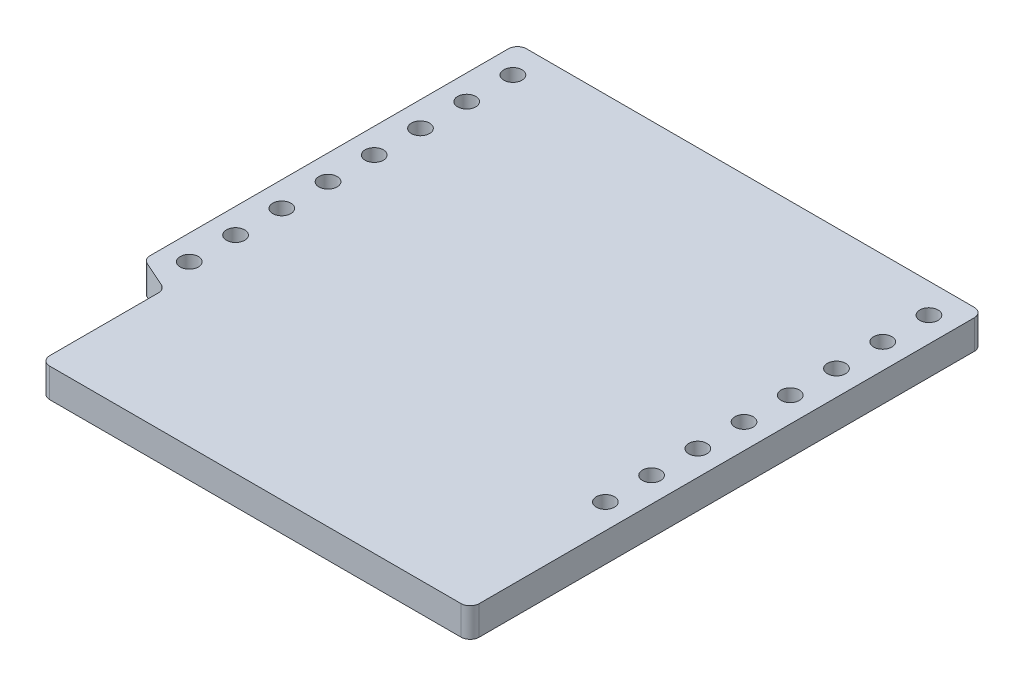
ISO-10303-21;
HEADER;
FILE_DESCRIPTION(('STEP AP214'),'2;1');
FILE_NAME('part.step','',(''),(''),'','','');
FILE_SCHEMA(('AUTOMOTIVE_DESIGN { 1 0 10303 214 1 1 1 1 }'));
ENDSEC;
DATA;
#1=APPLICATION_CONTEXT('core data for automotive mechanical design processes');
#2=APPLICATION_PROTOCOL_DEFINITION('international standard','automotive_design',2000,#1);
#3=PRODUCT_CONTEXT('',#1,'mechanical');
#4=PRODUCT('Part','Part','',(#3));
#5=PRODUCT_RELATED_PRODUCT_CATEGORY('part','',(#4));
#6=PRODUCT_DEFINITION_FORMATION('','',#4);
#7=PRODUCT_DEFINITION_CONTEXT('part definition',#1,'design');
#8=PRODUCT_DEFINITION('design','',#6,#7);
#9=PRODUCT_DEFINITION_SHAPE('','',#8);
#10=(LENGTH_UNIT() NAMED_UNIT(*) SI_UNIT(.MILLI.,.METRE.));
#11=(NAMED_UNIT(*) PLANE_ANGLE_UNIT() SI_UNIT($,.RADIAN.));
#12=(NAMED_UNIT(*) SI_UNIT($,.STERADIAN.) SOLID_ANGLE_UNIT());
#13=UNCERTAINTY_MEASURE_WITH_UNIT(LENGTH_MEASURE(1.E-05),#10,'distance_accuracy_value','');
#14=(GEOMETRIC_REPRESENTATION_CONTEXT(3) GLOBAL_UNCERTAINTY_ASSIGNED_CONTEXT((#13)) GLOBAL_UNIT_ASSIGNED_CONTEXT((#10,
#11,#12)) REPRESENTATION_CONTEXT('',''));
#15=CARTESIAN_POINT('',(0.,0.,0.));
#16=DIRECTION('',(0.,0.,1.));
#17=DIRECTION('',(1.,0.,0.));
#18=AXIS2_PLACEMENT_3D('',#15,#16,#17);
#19=CARTESIAN_POINT('',(0.,1.6,0.));
#20=DIRECTION('',(0.,-1.,0.));
#21=DIRECTION('',(0.,0.,-1.));
#22=AXIS2_PLACEMENT_3D('',#19,#20,#21);
#23=PLANE('',#22);
#24=DIRECTION('',(0.,0.,1.));
#25=VECTOR('',#24,1.);
#26=CARTESIAN_POINT('',(-10.8,1.6,0.));
#27=LINE('',#26,#25);
#28=CARTESIAN_POINT('',(-10.8,1.6,-6.47529620340124));
#29=VERTEX_POINT('',#28);
#30=CARTESIAN_POINT('',(-10.8,1.6,-0.5));
#31=VERTEX_POINT('',#30);
#32=EDGE_CURVE('E207',#29,#31,#27,.T.);
#33=ORIENTED_EDGE('',*,*,#32,.T.);
#34=CARTESIAN_POINT('',(-10.3,1.6,-0.5));
#35=DIRECTION('',(0.,-1.,0.));
#36=DIRECTION('',(0.,0.,-1.));
#37=AXIS2_PLACEMENT_3D('',#34,#35,#36);
#38=CIRCLE('',#37,0.5);
#39=CARTESIAN_POINT('',(-10.3,1.6,0.));
#40=VERTEX_POINT('',#39);
#41=EDGE_CURVE('E176',#31,#40,#38,.F.);
#42=ORIENTED_EDGE('',*,*,#41,.T.);
#43=DIRECTION('',(1.,0.,0.));
#44=VECTOR('',#43,1.);
#45=CARTESIAN_POINT('',(-10.8,1.6,0.));
#46=LINE('',#45,#44);
#47=CARTESIAN_POINT('',(12.3,1.6,0.));
#48=VERTEX_POINT('',#47);
#49=EDGE_CURVE('E142',#40,#48,#46,.T.);
#50=ORIENTED_EDGE('',*,*,#49,.T.);
#51=CARTESIAN_POINT('',(12.3,1.6,-0.5));
#52=DIRECTION('',(0.,-1.,0.));
#53=DIRECTION('',(0.,0.,-1.));
#54=AXIS2_PLACEMENT_3D('',#51,#52,#53);
#55=CIRCLE('',#54,0.5);
#56=CARTESIAN_POINT('',(12.8,1.6,-0.5));
#57=VERTEX_POINT('',#56);
#58=EDGE_CURVE('E169',#48,#57,#55,.F.);
#59=ORIENTED_EDGE('',*,*,#58,.T.);
#60=DIRECTION('',(0.,0.,-1.));
#61=VECTOR('',#60,1.);
#62=CARTESIAN_POINT('',(12.8,1.6,0.));
#63=LINE('',#62,#61);
#64=CARTESIAN_POINT('',(12.8,1.6,-27.7));
#65=VERTEX_POINT('',#64);
#66=EDGE_CURVE('E149',#57,#65,#63,.T.);
#67=ORIENTED_EDGE('',*,*,#66,.T.);
#68=CARTESIAN_POINT('',(12.3,1.6,-27.7));
#69=DIRECTION('',(0.,-1.,0.));
#70=DIRECTION('',(0.,0.,-1.));
#71=AXIS2_PLACEMENT_3D('',#68,#69,#70);
#72=CIRCLE('',#71,0.5);
#73=CARTESIAN_POINT('',(12.3,1.6,-28.2));
#74=VERTEX_POINT('',#73);
#75=EDGE_CURVE('E171',#65,#74,#72,.F.);
#76=ORIENTED_EDGE('',*,*,#75,.T.);
#77=DIRECTION('',(-1.,0.,0.));
#78=VECTOR('',#77,1.);
#79=CARTESIAN_POINT('',(-12.8,1.6,-28.2));
#80=LINE('',#79,#78);
#81=CARTESIAN_POINT('',(-12.3,1.6,-28.2));
#82=VERTEX_POINT('',#81);
#83=EDGE_CURVE('E153',#74,#82,#80,.T.);
#84=ORIENTED_EDGE('',*,*,#83,.T.);
#85=CARTESIAN_POINT('',(-12.3,1.6,-27.7));
#86=DIRECTION('',(0.,-1.,0.));
#87=DIRECTION('',(0.,0.,-1.));
#88=AXIS2_PLACEMENT_3D('',#85,#86,#87);
#89=CIRCLE('',#88,0.5);
#90=CARTESIAN_POINT('',(-12.8,1.6,-27.7));
#91=VERTEX_POINT('',#90);
#92=EDGE_CURVE('E173',#82,#91,#89,.F.);
#93=ORIENTED_EDGE('',*,*,#92,.T.);
#94=DIRECTION('',(0.,0.,1.));
#95=VECTOR('',#94,1.);
#96=CARTESIAN_POINT('',(-12.8,1.6,-7.69045737061706));
#97=LINE('',#96,#95);
#98=CARTESIAN_POINT('',(-12.8,1.6,-8.01516116721582));
#99=VERTEX_POINT('',#98);
#100=EDGE_CURVE('E213',#91,#99,#97,.T.);
#101=ORIENTED_EDGE('',*,*,#100,.T.);
#102=CARTESIAN_POINT('',(-12.3,1.6,-8.01516116721582));
#103=DIRECTION('',(0.,-1.,0.));
#104=DIRECTION('',(0.,0.,-1.));
#105=AXIS2_PLACEMENT_3D('',#102,#103,#104);
#106=CIRCLE('',#105,0.5);
#107=CARTESIAN_POINT('',(-12.5033683215379,1.6,-7.55838843839452));
#108=VERTEX_POINT('',#107);
#109=EDGE_CURVE('E54',#99,#108,#106,.F.);
#110=ORIENTED_EDGE('',*,*,#109,.T.);
#111=DIRECTION('',(0.913545457642602,0.,0.406736643075797));
#112=VECTOR('',#111,1.);
#113=CARTESIAN_POINT('',(-10.8,1.6,-6.8));
#114=LINE('',#113,#112);
#115=CARTESIAN_POINT('',(-11.0966316784621,1.6,-6.93206893222254));
#116=VERTEX_POINT('',#115);
#117=EDGE_CURVE('E208',#108,#116,#114,.T.);
#118=ORIENTED_EDGE('',*,*,#117,.T.);
#119=CARTESIAN_POINT('',(-11.3,1.6,-6.47529620340124));
#120=DIRECTION('',(0.,-1.,0.));
#121=DIRECTION('',(0.,0.,-1.));
#122=AXIS2_PLACEMENT_3D('',#119,#120,#121);
#123=CIRCLE('',#122,0.5);
#124=EDGE_CURVE('E11',#116,#29,#123,.T.);
#125=ORIENTED_EDGE('',*,*,#124,.T.);
#126=EDGE_LOOP('',(#33,#42,#50,#59,#67,#76,#84,#93,#101,#110,#118,#125));
#127=FACE_BOUND('',#126,.T.);
#128=CARTESIAN_POINT('',(-11.43,1.6,-26.58));
#129=DIRECTION('',(0.,1.,0.));
#130=DIRECTION('',(0.,0.,1.));
#131=AXIS2_PLACEMENT_3D('',#128,#129,#130);
#132=CIRCLE('',#131,0.500000000000001);
#133=CARTESIAN_POINT('',(-11.43,1.6,-26.08));
#134=VERTEX_POINT('',#133);
#135=EDGE_CURVE('E221',#134,#134,#132,.T.);
#136=ORIENTED_EDGE('',*,*,#135,.F.);
#137=EDGE_LOOP('',(#136));
#138=FACE_BOUND('',#137,.T.);
#139=CARTESIAN_POINT('',(11.43,1.6,-26.58));
#140=DIRECTION('',(0.,1.,0.));
#141=DIRECTION('',(0.,0.,1.));
#142=AXIS2_PLACEMENT_3D('',#139,#140,#141);
#143=CIRCLE('',#142,0.500000000000001);
#144=CARTESIAN_POINT('',(11.43,1.6,-26.08));
#145=VERTEX_POINT('',#144);
#146=EDGE_CURVE('E344',#145,#145,#143,.T.);
#147=ORIENTED_EDGE('',*,*,#146,.F.);
#148=EDGE_LOOP('',(#147));
#149=FACE_BOUND('',#148,.T.);
#150=CARTESIAN_POINT('',(-11.43,1.6,-24.04));
#151=DIRECTION('',(0.,1.,0.));
#152=DIRECTION('',(0.,0.,1.));
#153=AXIS2_PLACEMENT_3D('',#150,#151,#152);
#154=CIRCLE('',#153,0.500000000000001);
#155=CARTESIAN_POINT('',(-11.43,1.6,-23.54));
#156=VERTEX_POINT('',#155);
#157=EDGE_CURVE('E348',#156,#156,#154,.T.);
#158=ORIENTED_EDGE('',*,*,#157,.F.);
#159=EDGE_LOOP('',(#158));
#160=FACE_BOUND('',#159,.T.);
#161=CARTESIAN_POINT('',(11.43,1.6,-24.04));
#162=DIRECTION('',(0.,1.,0.));
#163=DIRECTION('',(0.,0.,1.));
#164=AXIS2_PLACEMENT_3D('',#161,#162,#163);
#165=CIRCLE('',#164,0.500000000000001);
#166=CARTESIAN_POINT('',(11.43,1.6,-23.54));
#167=VERTEX_POINT('',#166);
#168=EDGE_CURVE('E557',#167,#167,#165,.T.);
#169=ORIENTED_EDGE('',*,*,#168,.F.);
#170=EDGE_LOOP('',(#169));
#171=FACE_BOUND('',#170,.T.);
#172=CARTESIAN_POINT('',(-11.43,1.6,-21.5));
#173=DIRECTION('',(0.,1.,0.));
#174=DIRECTION('',(0.,0.,1.));
#175=AXIS2_PLACEMENT_3D('',#172,#173,#174);
#176=CIRCLE('',#175,0.499999999999999);
#177=CARTESIAN_POINT('',(-11.43,1.6,-21.));
#178=VERTEX_POINT('',#177);
#179=EDGE_CURVE('E561',#178,#178,#176,.T.);
#180=ORIENTED_EDGE('',*,*,#179,.F.);
#181=EDGE_LOOP('',(#180));
#182=FACE_BOUND('',#181,.T.);
#183=CARTESIAN_POINT('',(11.43,1.6,-21.5));
#184=DIRECTION('',(0.,1.,0.));
#185=DIRECTION('',(0.,0.,1.));
#186=AXIS2_PLACEMENT_3D('',#183,#184,#185);
#187=CIRCLE('',#186,0.499999999999999);
#188=CARTESIAN_POINT('',(11.43,1.6,-21.));
#189=VERTEX_POINT('',#188);
#190=EDGE_CURVE('E565',#189,#189,#187,.T.);
#191=ORIENTED_EDGE('',*,*,#190,.F.);
#192=EDGE_LOOP('',(#191));
#193=FACE_BOUND('',#192,.T.);
#194=CARTESIAN_POINT('',(-11.43,1.6,-18.96));
#195=DIRECTION('',(0.,1.,0.));
#196=DIRECTION('',(0.,0.,1.));
#197=AXIS2_PLACEMENT_3D('',#194,#195,#196);
#198=CIRCLE('',#197,0.499999999999999);
#199=CARTESIAN_POINT('',(-11.43,1.6,-18.46));
#200=VERTEX_POINT('',#199);
#201=EDGE_CURVE('E569',#200,#200,#198,.T.);
#202=ORIENTED_EDGE('',*,*,#201,.F.);
#203=EDGE_LOOP('',(#202));
#204=FACE_BOUND('',#203,.T.);
#205=CARTESIAN_POINT('',(11.43,1.6,-18.96));
#206=DIRECTION('',(0.,1.,0.));
#207=DIRECTION('',(0.,0.,1.));
#208=AXIS2_PLACEMENT_3D('',#205,#206,#207);
#209=CIRCLE('',#208,0.500000000000003);
#210=CARTESIAN_POINT('',(11.43,1.6,-18.46));
#211=VERTEX_POINT('',#210);
#212=EDGE_CURVE('E573',#211,#211,#209,.T.);
#213=ORIENTED_EDGE('',*,*,#212,.F.);
#214=EDGE_LOOP('',(#213));
#215=FACE_BOUND('',#214,.T.);
#216=CARTESIAN_POINT('',(-11.43,1.6,-16.42));
#217=DIRECTION('',(0.,1.,0.));
#218=DIRECTION('',(0.,0.,1.));
#219=AXIS2_PLACEMENT_3D('',#216,#217,#218);
#220=CIRCLE('',#219,0.499999999999999);
#221=CARTESIAN_POINT('',(-11.43,1.6,-15.92));
#222=VERTEX_POINT('',#221);
#223=EDGE_CURVE('E577',#222,#222,#220,.T.);
#224=ORIENTED_EDGE('',*,*,#223,.F.);
#225=EDGE_LOOP('',(#224));
#226=FACE_BOUND('',#225,.T.);
#227=CARTESIAN_POINT('',(11.43,1.6,-16.42));
#228=DIRECTION('',(0.,1.,0.));
#229=DIRECTION('',(0.,0.,1.));
#230=AXIS2_PLACEMENT_3D('',#227,#228,#229);
#231=CIRCLE('',#230,0.499999999999999);
#232=CARTESIAN_POINT('',(11.43,1.6,-15.92));
#233=VERTEX_POINT('',#232);
#234=EDGE_CURVE('E581',#233,#233,#231,.T.);
#235=ORIENTED_EDGE('',*,*,#234,.F.);
#236=EDGE_LOOP('',(#235));
#237=FACE_BOUND('',#236,.T.);
#238=CARTESIAN_POINT('',(-11.43,1.6,-13.88));
#239=DIRECTION('',(0.,1.,0.));
#240=DIRECTION('',(0.,0.,1.));
#241=AXIS2_PLACEMENT_3D('',#238,#239,#240);
#242=CIRCLE('',#241,0.499999999999999);
#243=CARTESIAN_POINT('',(-11.43,1.6,-13.38));
#244=VERTEX_POINT('',#243);
#245=EDGE_CURVE('E585',#244,#244,#242,.T.);
#246=ORIENTED_EDGE('',*,*,#245,.F.);
#247=EDGE_LOOP('',(#246));
#248=FACE_BOUND('',#247,.T.);
#249=CARTESIAN_POINT('',(11.43,1.6,-13.88));
#250=DIRECTION('',(0.,1.,0.));
#251=DIRECTION('',(0.,0.,1.));
#252=AXIS2_PLACEMENT_3D('',#249,#250,#251);
#253=CIRCLE('',#252,0.499999999999999);
#254=CARTESIAN_POINT('',(11.43,1.6,-13.38));
#255=VERTEX_POINT('',#254);
#256=EDGE_CURVE('E589',#255,#255,#253,.T.);
#257=ORIENTED_EDGE('',*,*,#256,.F.);
#258=EDGE_LOOP('',(#257));
#259=FACE_BOUND('',#258,.T.);
#260=CARTESIAN_POINT('',(-11.43,1.6,-11.34));
#261=DIRECTION('',(0.,1.,0.));
#262=DIRECTION('',(0.,0.,1.));
#263=AXIS2_PLACEMENT_3D('',#260,#261,#262);
#264=CIRCLE('',#263,0.499999999999999);
#265=CARTESIAN_POINT('',(-11.43,1.6,-10.84));
#266=VERTEX_POINT('',#265);
#267=EDGE_CURVE('E593',#266,#266,#264,.T.);
#268=ORIENTED_EDGE('',*,*,#267,.F.);
#269=EDGE_LOOP('',(#268));
#270=FACE_BOUND('',#269,.T.);
#271=CARTESIAN_POINT('',(11.43,1.6,-11.34));
#272=DIRECTION('',(0.,1.,0.));
#273=DIRECTION('',(0.,0.,1.));
#274=AXIS2_PLACEMENT_3D('',#271,#272,#273);
#275=CIRCLE('',#274,0.499999999999999);
#276=CARTESIAN_POINT('',(11.43,1.6,-10.84));
#277=VERTEX_POINT('',#276);
#278=EDGE_CURVE('E597',#277,#277,#275,.T.);
#279=ORIENTED_EDGE('',*,*,#278,.F.);
#280=EDGE_LOOP('',(#279));
#281=FACE_BOUND('',#280,.T.);
#282=CARTESIAN_POINT('',(-11.43,1.6,-8.8));
#283=DIRECTION('',(0.,1.,0.));
#284=DIRECTION('',(0.,0.,1.));
#285=AXIS2_PLACEMENT_3D('',#282,#283,#284);
#286=CIRCLE('',#285,0.499999999999999);
#287=CARTESIAN_POINT('',(-11.43,1.6,-8.3));
#288=VERTEX_POINT('',#287);
#289=EDGE_CURVE('E601',#288,#288,#286,.T.);
#290=ORIENTED_EDGE('',*,*,#289,.F.);
#291=EDGE_LOOP('',(#290));
#292=FACE_BOUND('',#291,.T.);
#293=CARTESIAN_POINT('',(11.43,1.6,-8.8));
#294=DIRECTION('',(0.,1.,0.));
#295=DIRECTION('',(0.,0.,1.));
#296=AXIS2_PLACEMENT_3D('',#293,#294,#295);
#297=CIRCLE('',#296,0.499999999999999);
#298=CARTESIAN_POINT('',(11.43,1.6,-8.3));
#299=VERTEX_POINT('',#298);
#300=EDGE_CURVE('E603',#299,#299,#297,.T.);
#301=ORIENTED_EDGE('',*,*,#300,.F.);
#302=EDGE_LOOP('',(#301));
#303=FACE_BOUND('',#302,.T.);
#304=ADVANCED_FACE('F32',(#127,#138,#149,#160,#171,#182,#193,#204,#215,#226,#237,#248,#259,#270,
#281,#292,#303),#23,.F.);
#305=CARTESIAN_POINT('',(0.,0.,0.));
#306=DIRECTION('',(0.,-1.,0.));
#307=DIRECTION('',(0.,0.,-1.));
#308=AXIS2_PLACEMENT_3D('',#305,#306,#307);
#309=PLANE('',#308);
#310=CARTESIAN_POINT('',(-11.43,0.,-8.8));
#311=DIRECTION('',(0.,1.,0.));
#312=DIRECTION('',(0.,0.,1.));
#313=AXIS2_PLACEMENT_3D('',#310,#311,#312);
#314=CIRCLE('',#313,0.499999999999999);
#315=CARTESIAN_POINT('',(-11.43,0.,-8.3));
#316=VERTEX_POINT('',#315);
#317=EDGE_CURVE('E604',#316,#316,#314,.T.);
#318=ORIENTED_EDGE('',*,*,#317,.T.);
#319=EDGE_LOOP('',(#318));
#320=FACE_BOUND('',#319,.T.);
#321=CARTESIAN_POINT('',(-11.43,0.,-11.34));
#322=DIRECTION('',(0.,1.,0.));
#323=DIRECTION('',(0.,0.,1.));
#324=AXIS2_PLACEMENT_3D('',#321,#322,#323);
#325=CIRCLE('',#324,0.499999999999999);
#326=CARTESIAN_POINT('',(-11.43,0.,-10.84));
#327=VERTEX_POINT('',#326);
#328=EDGE_CURVE('E615',#327,#327,#325,.T.);
#329=ORIENTED_EDGE('',*,*,#328,.T.);
#330=EDGE_LOOP('',(#329));
#331=FACE_BOUND('',#330,.T.);
#332=CARTESIAN_POINT('',(-11.43,0.,-13.88));
#333=DIRECTION('',(0.,1.,0.));
#334=DIRECTION('',(0.,0.,1.));
#335=AXIS2_PLACEMENT_3D('',#332,#333,#334);
#336=CIRCLE('',#335,0.499999999999999);
#337=CARTESIAN_POINT('',(-11.43,0.,-13.38));
#338=VERTEX_POINT('',#337);
#339=EDGE_CURVE('E623',#338,#338,#336,.T.);
#340=ORIENTED_EDGE('',*,*,#339,.T.);
#341=EDGE_LOOP('',(#340));
#342=FACE_BOUND('',#341,.T.);
#343=CARTESIAN_POINT('',(-11.43,0.,-16.42));
#344=DIRECTION('',(0.,1.,0.));
#345=DIRECTION('',(0.,0.,1.));
#346=AXIS2_PLACEMENT_3D('',#343,#344,#345);
#347=CIRCLE('',#346,0.499999999999999);
#348=CARTESIAN_POINT('',(-11.43,0.,-15.92));
#349=VERTEX_POINT('',#348);
#350=EDGE_CURVE('E631',#349,#349,#347,.T.);
#351=ORIENTED_EDGE('',*,*,#350,.T.);
#352=EDGE_LOOP('',(#351));
#353=FACE_BOUND('',#352,.T.);
#354=CARTESIAN_POINT('',(-11.43,0.,-18.96));
#355=DIRECTION('',(0.,1.,0.));
#356=DIRECTION('',(0.,0.,1.));
#357=AXIS2_PLACEMENT_3D('',#354,#355,#356);
#358=CIRCLE('',#357,0.499999999999999);
#359=CARTESIAN_POINT('',(-11.43,0.,-18.46));
#360=VERTEX_POINT('',#359);
#361=EDGE_CURVE('E639',#360,#360,#358,.T.);
#362=ORIENTED_EDGE('',*,*,#361,.T.);
#363=EDGE_LOOP('',(#362));
#364=FACE_BOUND('',#363,.T.);
#365=CARTESIAN_POINT('',(-11.43,0.,-21.5));
#366=DIRECTION('',(0.,1.,0.));
#367=DIRECTION('',(0.,0.,1.));
#368=AXIS2_PLACEMENT_3D('',#365,#366,#367);
#369=CIRCLE('',#368,0.499999999999999);
#370=CARTESIAN_POINT('',(-11.43,0.,-21.));
#371=VERTEX_POINT('',#370);
#372=EDGE_CURVE('E647',#371,#371,#369,.T.);
#373=ORIENTED_EDGE('',*,*,#372,.T.);
#374=EDGE_LOOP('',(#373));
#375=FACE_BOUND('',#374,.T.);
#376=CARTESIAN_POINT('',(-11.43,0.,-24.04));
#377=DIRECTION('',(0.,1.,0.));
#378=DIRECTION('',(0.,0.,1.));
#379=AXIS2_PLACEMENT_3D('',#376,#377,#378);
#380=CIRCLE('',#379,0.500000000000001);
#381=CARTESIAN_POINT('',(-11.43,0.,-23.54));
#382=VERTEX_POINT('',#381);
#383=EDGE_CURVE('E353',#382,#382,#380,.T.);
#384=ORIENTED_EDGE('',*,*,#383,.T.);
#385=EDGE_LOOP('',(#384));
#386=FACE_BOUND('',#385,.T.);
#387=CARTESIAN_POINT('',(-11.43,0.,-26.58));
#388=DIRECTION('',(0.,1.,0.));
#389=DIRECTION('',(0.,0.,1.));
#390=AXIS2_PLACEMENT_3D('',#387,#388,#389);
#391=CIRCLE('',#390,0.500000000000001);
#392=CARTESIAN_POINT('',(-11.43,0.,-26.08));
#393=VERTEX_POINT('',#392);
#394=EDGE_CURVE('E350',#393,#393,#391,.T.);
#395=ORIENTED_EDGE('',*,*,#394,.T.);
#396=EDGE_LOOP('',(#395));
#397=FACE_BOUND('',#396,.T.);
#398=DIRECTION('',(1.,0.,0.));
#399=VECTOR('',#398,1.);
#400=CARTESIAN_POINT('',(-10.8,0.,0.));
#401=LINE('',#400,#399);
#402=CARTESIAN_POINT('',(-10.3,0.,0.));
#403=VERTEX_POINT('',#402);
#404=CARTESIAN_POINT('',(12.3,0.,0.));
#405=VERTEX_POINT('',#404);
#406=EDGE_CURVE('E139',#403,#405,#401,.T.);
#407=ORIENTED_EDGE('',*,*,#406,.F.);
#408=CARTESIAN_POINT('',(-10.3,0.,-0.5));
#409=DIRECTION('',(0.,-1.,0.));
#410=DIRECTION('',(0.,0.,-1.));
#411=AXIS2_PLACEMENT_3D('',#408,#409,#410);
#412=CIRCLE('',#411,0.5);
#413=CARTESIAN_POINT('',(-10.8,0.,-0.5));
#414=VERTEX_POINT('',#413);
#415=EDGE_CURVE('E122',#403,#414,#412,.T.);
#416=ORIENTED_EDGE('',*,*,#415,.T.);
#417=DIRECTION('',(0.,0.,1.));
#418=VECTOR('',#417,1.);
#419=CARTESIAN_POINT('',(-10.8,0.,0.));
#420=LINE('',#419,#418);
#421=CARTESIAN_POINT('',(-10.8,0.,-6.47529620340124));
#422=VERTEX_POINT('',#421);
#423=EDGE_CURVE('E150',#422,#414,#420,.T.);
#424=ORIENTED_EDGE('',*,*,#423,.F.);
#425=CARTESIAN_POINT('',(-11.3,0.,-6.47529620340124));
#426=DIRECTION('',(0.,-1.,0.));
#427=DIRECTION('',(0.,0.,-1.));
#428=AXIS2_PLACEMENT_3D('',#425,#426,#427);
#429=CIRCLE('',#428,0.5);
#430=CARTESIAN_POINT('',(-11.0966316784621,0.,-6.93206893222254));
#431=VERTEX_POINT('',#430);
#432=EDGE_CURVE('E40',#422,#431,#429,.F.);
#433=ORIENTED_EDGE('',*,*,#432,.T.);
#434=DIRECTION('',(0.913545457642602,0.,0.406736643075797));
#435=VECTOR('',#434,1.);
#436=CARTESIAN_POINT('',(-10.8,0.,-6.8));
#437=LINE('',#436,#435);
#438=CARTESIAN_POINT('',(-12.5033683215379,0.,-7.55838843839452));
#439=VERTEX_POINT('',#438);
#440=EDGE_CURVE('E155',#439,#431,#437,.T.);
#441=ORIENTED_EDGE('',*,*,#440,.F.);
#442=CARTESIAN_POINT('',(-12.3,0.,-8.01516116721582));
#443=DIRECTION('',(0.,-1.,0.));
#444=DIRECTION('',(0.,0.,-1.));
#445=AXIS2_PLACEMENT_3D('',#442,#443,#444);
#446=CIRCLE('',#445,0.5);
#447=CARTESIAN_POINT('',(-12.8,0.,-8.01516116721582));
#448=VERTEX_POINT('',#447);
#449=EDGE_CURVE('E133',#439,#448,#446,.T.);
#450=ORIENTED_EDGE('',*,*,#449,.T.);
#451=DIRECTION('',(0.,0.,1.));
#452=VECTOR('',#451,1.);
#453=CARTESIAN_POINT('',(-12.8,0.,-7.69045737061706));
#454=LINE('',#453,#452);
#455=CARTESIAN_POINT('',(-12.8,0.,-27.7));
#456=VERTEX_POINT('',#455);
#457=EDGE_CURVE('E201',#456,#448,#454,.T.);
#458=ORIENTED_EDGE('',*,*,#457,.F.);
#459=CARTESIAN_POINT('',(-12.3,0.,-27.7));
#460=DIRECTION('',(0.,-1.,0.));
#461=DIRECTION('',(0.,0.,-1.));
#462=AXIS2_PLACEMENT_3D('',#459,#460,#461);
#463=CIRCLE('',#462,0.5);
#464=CARTESIAN_POINT('',(-12.3,0.,-28.2));
#465=VERTEX_POINT('',#464);
#466=EDGE_CURVE('E163',#456,#465,#463,.T.);
#467=ORIENTED_EDGE('',*,*,#466,.T.);
#468=DIRECTION('',(-1.,0.,0.));
#469=VECTOR('',#468,1.);
#470=CARTESIAN_POINT('',(-12.8,0.,-28.2));
#471=LINE('',#470,#469);
#472=CARTESIAN_POINT('',(12.3,0.,-28.2));
#473=VERTEX_POINT('',#472);
#474=EDGE_CURVE('E220',#473,#465,#471,.T.);
#475=ORIENTED_EDGE('',*,*,#474,.F.);
#476=CARTESIAN_POINT('',(12.3,0.,-27.7));
#477=DIRECTION('',(0.,-1.,0.));
#478=DIRECTION('',(0.,0.,-1.));
#479=AXIS2_PLACEMENT_3D('',#476,#477,#478);
#480=CIRCLE('',#479,0.5);
#481=CARTESIAN_POINT('',(12.8,0.,-27.7));
#482=VERTEX_POINT('',#481);
#483=EDGE_CURVE('E161',#473,#482,#480,.T.);
#484=ORIENTED_EDGE('',*,*,#483,.T.);
#485=DIRECTION('',(0.,0.,-1.));
#486=VECTOR('',#485,1.);
#487=CARTESIAN_POINT('',(12.8,0.,0.));
#488=LINE('',#487,#486);
#489=CARTESIAN_POINT('',(12.8,0.,-0.5));
#490=VERTEX_POINT('',#489);
#491=EDGE_CURVE('E217',#490,#482,#488,.T.);
#492=ORIENTED_EDGE('',*,*,#491,.F.);
#493=CARTESIAN_POINT('',(12.3,0.,-0.5));
#494=DIRECTION('',(0.,-1.,0.));
#495=DIRECTION('',(0.,0.,-1.));
#496=AXIS2_PLACEMENT_3D('',#493,#494,#495);
#497=CIRCLE('',#496,0.5);
#498=EDGE_CURVE('E143',#490,#405,#497,.T.);
#499=ORIENTED_EDGE('',*,*,#498,.T.);
#500=EDGE_LOOP('',(#407,#416,#424,#433,#441,#450,#458,#467,#475,#484,#492,#499));
#501=FACE_BOUND('',#500,.T.);
#502=CARTESIAN_POINT('',(11.43,0.,-26.58));
#503=DIRECTION('',(0.,1.,0.));
#504=DIRECTION('',(0.,0.,1.));
#505=AXIS2_PLACEMENT_3D('',#502,#503,#504);
#506=CIRCLE('',#505,0.500000000000001);
#507=CARTESIAN_POINT('',(11.43,0.,-26.08));
#508=VERTEX_POINT('',#507);
#509=EDGE_CURVE('E347',#508,#508,#506,.T.);
#510=ORIENTED_EDGE('',*,*,#509,.T.);
#511=EDGE_LOOP('',(#510));
#512=FACE_BOUND('',#511,.T.);
#513=CARTESIAN_POINT('',(11.43,0.,-24.04));
#514=DIRECTION('',(0.,1.,0.));
#515=DIRECTION('',(0.,0.,1.));
#516=AXIS2_PLACEMENT_3D('',#513,#514,#515);
#517=CIRCLE('',#516,0.500000000000001);
#518=CARTESIAN_POINT('',(11.43,0.,-23.54));
#519=VERTEX_POINT('',#518);
#520=EDGE_CURVE('E651',#519,#519,#517,.T.);
#521=ORIENTED_EDGE('',*,*,#520,.T.);
#522=EDGE_LOOP('',(#521));
#523=FACE_BOUND('',#522,.T.);
#524=CARTESIAN_POINT('',(11.43,0.,-21.5));
#525=DIRECTION('',(0.,1.,0.));
#526=DIRECTION('',(0.,0.,1.));
#527=AXIS2_PLACEMENT_3D('',#524,#525,#526);
#528=CIRCLE('',#527,0.499999999999999);
#529=CARTESIAN_POINT('',(11.43,0.,-21.));
#530=VERTEX_POINT('',#529);
#531=EDGE_CURVE('E643',#530,#530,#528,.T.);
#532=ORIENTED_EDGE('',*,*,#531,.T.);
#533=EDGE_LOOP('',(#532));
#534=FACE_BOUND('',#533,.T.);
#535=CARTESIAN_POINT('',(11.43,0.,-18.96));
#536=DIRECTION('',(0.,1.,0.));
#537=DIRECTION('',(0.,0.,1.));
#538=AXIS2_PLACEMENT_3D('',#535,#536,#537);
#539=CIRCLE('',#538,0.500000000000003);
#540=CARTESIAN_POINT('',(11.43,0.,-18.46));
#541=VERTEX_POINT('',#540);
#542=EDGE_CURVE('E635',#541,#541,#539,.T.);
#543=ORIENTED_EDGE('',*,*,#542,.T.);
#544=EDGE_LOOP('',(#543));
#545=FACE_BOUND('',#544,.T.);
#546=CARTESIAN_POINT('',(11.43,0.,-16.42));
#547=DIRECTION('',(0.,1.,0.));
#548=DIRECTION('',(0.,0.,1.));
#549=AXIS2_PLACEMENT_3D('',#546,#547,#548);
#550=CIRCLE('',#549,0.499999999999999);
#551=CARTESIAN_POINT('',(11.43,0.,-15.92));
#552=VERTEX_POINT('',#551);
#553=EDGE_CURVE('E627',#552,#552,#550,.T.);
#554=ORIENTED_EDGE('',*,*,#553,.T.);
#555=EDGE_LOOP('',(#554));
#556=FACE_BOUND('',#555,.T.);
#557=CARTESIAN_POINT('',(11.43,0.,-13.88));
#558=DIRECTION('',(0.,1.,0.));
#559=DIRECTION('',(0.,0.,1.));
#560=AXIS2_PLACEMENT_3D('',#557,#558,#559);
#561=CIRCLE('',#560,0.499999999999999);
#562=CARTESIAN_POINT('',(11.43,0.,-13.38));
#563=VERTEX_POINT('',#562);
#564=EDGE_CURVE('E619',#563,#563,#561,.T.);
#565=ORIENTED_EDGE('',*,*,#564,.T.);
#566=EDGE_LOOP('',(#565));
#567=FACE_BOUND('',#566,.T.);
#568=CARTESIAN_POINT('',(11.43,0.,-11.34));
#569=DIRECTION('',(0.,1.,0.));
#570=DIRECTION('',(0.,0.,1.));
#571=AXIS2_PLACEMENT_3D('',#568,#569,#570);
#572=CIRCLE('',#571,0.499999999999999);
#573=CARTESIAN_POINT('',(11.43,0.,-10.84));
#574=VERTEX_POINT('',#573);
#575=EDGE_CURVE('E612',#574,#574,#572,.T.);
#576=ORIENTED_EDGE('',*,*,#575,.T.);
#577=EDGE_LOOP('',(#576));
#578=FACE_BOUND('',#577,.T.);
#579=CARTESIAN_POINT('',(11.43,0.,-8.8));
#580=DIRECTION('',(0.,1.,0.));
#581=DIRECTION('',(0.,0.,1.));
#582=AXIS2_PLACEMENT_3D('',#579,#580,#581);
#583=CIRCLE('',#582,0.499999999999999);
#584=CARTESIAN_POINT('',(11.43,0.,-8.3));
#585=VERTEX_POINT('',#584);
#586=EDGE_CURVE('E605',#585,#585,#583,.T.);
#587=ORIENTED_EDGE('',*,*,#586,.T.);
#588=EDGE_LOOP('',(#587));
#589=FACE_BOUND('',#588,.T.);
#590=ADVANCED_FACE('F146',(#320,#331,#342,#353,#364,#375,#386,#397,#501,#512,#523,#534,#545,
#556,#567,#578,#589),#309,.T.);
#591=CARTESIAN_POINT('',(12.8,1.6,0.));
#592=DIRECTION('',(-1.,0.,0.));
#593=DIRECTION('',(0.,0.,1.));
#594=AXIS2_PLACEMENT_3D('',#591,#592,#593);
#595=PLANE('',#594);
#596=ORIENTED_EDGE('',*,*,#491,.T.);
#597=DIRECTION('',(0.,-1.,0.));
#598=VECTOR('',#597,1.);
#599=CARTESIAN_POINT('',(12.8,1.6,-27.7));
#600=LINE('',#599,#598);
#601=EDGE_CURVE('E195',#482,#65,#600,.F.);
#602=ORIENTED_EDGE('',*,*,#601,.T.);
#603=ORIENTED_EDGE('',*,*,#66,.F.);
#604=DIRECTION('',(0.,-1.,0.));
#605=VECTOR('',#604,1.);
#606=CARTESIAN_POINT('',(12.8,1.6,-0.5));
#607=LINE('',#606,#605);
#608=EDGE_CURVE('E192',#57,#490,#607,.T.);
#609=ORIENTED_EDGE('',*,*,#608,.T.);
#610=EDGE_LOOP('',(#596,#602,#603,#609));
#611=FACE_BOUND('',#610,.T.);
#612=ADVANCED_FACE('F249',(#611),#595,.F.);
#613=CARTESIAN_POINT('',(-12.8,1.6,-28.2));
#614=DIRECTION('',(0.,0.,1.));
#615=DIRECTION('',(1.,0.,0.));
#616=AXIS2_PLACEMENT_3D('',#613,#614,#615);
#617=PLANE('',#616);
#618=ORIENTED_EDGE('',*,*,#474,.T.);
#619=DIRECTION('',(0.,-1.,0.));
#620=VECTOR('',#619,1.);
#621=CARTESIAN_POINT('',(-12.3,1.6,-28.2));
#622=LINE('',#621,#620);
#623=EDGE_CURVE('E190',#465,#82,#622,.F.);
#624=ORIENTED_EDGE('',*,*,#623,.T.);
#625=ORIENTED_EDGE('',*,*,#83,.F.);
#626=DIRECTION('',(0.,-1.,0.));
#627=VECTOR('',#626,1.);
#628=CARTESIAN_POINT('',(12.3,1.6,-28.2));
#629=LINE('',#628,#627);
#630=EDGE_CURVE('E187',#74,#473,#629,.T.);
#631=ORIENTED_EDGE('',*,*,#630,.T.);
#632=EDGE_LOOP('',(#618,#624,#625,#631));
#633=FACE_BOUND('',#632,.T.);
#634=ADVANCED_FACE('F264',(#633),#617,.F.);
#635=CARTESIAN_POINT('',(-12.8,1.6,-7.69045737061706));
#636=DIRECTION('',(1.,0.,0.));
#637=DIRECTION('',(0.,0.,-1.));
#638=AXIS2_PLACEMENT_3D('',#635,#636,#637);
#639=PLANE('',#638);
#640=ORIENTED_EDGE('',*,*,#457,.T.);
#641=DIRECTION('',(0.,-1.,0.));
#642=VECTOR('',#641,1.);
#643=CARTESIAN_POINT('',(-12.8,1.6,-8.01516116721582));
#644=LINE('',#643,#642);
#645=EDGE_CURVE('E185',#448,#99,#644,.F.);
#646=ORIENTED_EDGE('',*,*,#645,.T.);
#647=ORIENTED_EDGE('',*,*,#100,.F.);
#648=DIRECTION('',(0.,-1.,0.));
#649=VECTOR('',#648,1.);
#650=CARTESIAN_POINT('',(-12.8,1.6,-27.7));
#651=LINE('',#650,#649);
#652=EDGE_CURVE('E182',#91,#456,#651,.T.);
#653=ORIENTED_EDGE('',*,*,#652,.T.);
#654=EDGE_LOOP('',(#640,#646,#647,#653));
#655=FACE_BOUND('',#654,.T.);
#656=ADVANCED_FACE('F228',(#655),#639,.F.);
#657=CARTESIAN_POINT('',(-10.8,1.6,-6.8));
#658=DIRECTION('',(0.406736643075797,0.,-0.913545457642602));
#659=DIRECTION('',(-0.913545457642602,0.,-0.406736643075797));
#660=AXIS2_PLACEMENT_3D('',#657,#658,#659);
#661=PLANE('',#660);
#662=ORIENTED_EDGE('',*,*,#440,.T.);
#663=DIRECTION('',(0.,-1.,0.));
#664=VECTOR('',#663,1.);
#665=CARTESIAN_POINT('',(-11.0966316784621,1.6,-6.93206893222254));
#666=LINE('',#665,#664);
#667=EDGE_CURVE('E47',#431,#116,#666,.F.);
#668=ORIENTED_EDGE('',*,*,#667,.T.);
#669=ORIENTED_EDGE('',*,*,#117,.F.);
#670=DIRECTION('',(0.,-1.,0.));
#671=VECTOR('',#670,1.);
#672=CARTESIAN_POINT('',(-12.5033683215379,1.6,-7.55838843839452));
#673=LINE('',#672,#671);
#674=EDGE_CURVE('E178',#108,#439,#673,.T.);
#675=ORIENTED_EDGE('',*,*,#674,.T.);
#676=EDGE_LOOP('',(#662,#668,#669,#675));
#677=FACE_BOUND('',#676,.T.);
#678=ADVANCED_FACE('F199',(#677),#661,.F.);
#679=CARTESIAN_POINT('',(-10.8,1.6,0.));
#680=DIRECTION('',(1.,0.,0.));
#681=DIRECTION('',(0.,0.,-1.));
#682=AXIS2_PLACEMENT_3D('',#679,#680,#681);
#683=PLANE('',#682);
#684=ORIENTED_EDGE('',*,*,#423,.T.);
#685=DIRECTION('',(0.,-1.,0.));
#686=VECTOR('',#685,1.);
#687=CARTESIAN_POINT('',(-10.8,1.6,-0.5));
#688=LINE('',#687,#686);
#689=EDGE_CURVE('E127',#414,#31,#688,.F.);
#690=ORIENTED_EDGE('',*,*,#689,.T.);
#691=ORIENTED_EDGE('',*,*,#32,.F.);
#692=DIRECTION('',(0.,-1.,0.));
#693=VECTOR('',#692,1.);
#694=CARTESIAN_POINT('',(-10.8,0.,-6.47529620340124));
#695=LINE('',#694,#693);
#696=EDGE_CURVE('E132',#29,#422,#695,.T.);
#697=ORIENTED_EDGE('',*,*,#696,.T.);
#698=EDGE_LOOP('',(#684,#690,#691,#697));
#699=FACE_BOUND('',#698,.T.);
#700=ADVANCED_FACE('F210',(#699),#683,.F.);
#701=CARTESIAN_POINT('',(-10.8,1.6,0.));
#702=DIRECTION('',(0.,0.,-1.));
#703=DIRECTION('',(-1.,0.,0.));
#704=AXIS2_PLACEMENT_3D('',#701,#702,#703);
#705=PLANE('',#704);
#706=ORIENTED_EDGE('',*,*,#49,.F.);
#707=DIRECTION('',(0.,-1.,0.));
#708=VECTOR('',#707,1.);
#709=CARTESIAN_POINT('',(-10.3,1.6,0.));
#710=LINE('',#709,#708);
#711=EDGE_CURVE('E126',#40,#403,#710,.T.);
#712=ORIENTED_EDGE('',*,*,#711,.T.);
#713=ORIENTED_EDGE('',*,*,#406,.T.);
#714=DIRECTION('',(0.,-1.,0.));
#715=VECTOR('',#714,1.);
#716=CARTESIAN_POINT('',(12.3,1.6,0.));
#717=LINE('',#716,#715);
#718=EDGE_CURVE('E144',#405,#48,#717,.F.);
#719=ORIENTED_EDGE('',*,*,#718,.T.);
#720=EDGE_LOOP('',(#706,#712,#713,#719));
#721=FACE_BOUND('',#720,.T.);
#722=ADVANCED_FACE('F138',(#721),#705,.F.);
#723=CARTESIAN_POINT('',(-11.43,1.6,-26.58));
#724=DIRECTION('',(0.,-1.,0.));
#725=DIRECTION('',(0.,0.,-1.));
#726=AXIS2_PLACEMENT_3D('',#723,#724,#725);
#727=CYLINDRICAL_SURFACE('',#726,0.500000000000001);
#728=ORIENTED_EDGE('',*,*,#135,.T.);
#729=EDGE_LOOP('',(#728));
#730=FACE_BOUND('',#729,.T.);
#731=ORIENTED_EDGE('',*,*,#394,.F.);
#732=EDGE_LOOP('',(#731));
#733=FACE_BOUND('',#732,.T.);
#734=ADVANCED_FACE('F253',(#730,#733),#727,.F.);
#735=CARTESIAN_POINT('',(11.43,1.6,-26.58));
#736=DIRECTION('',(0.,-1.,0.));
#737=DIRECTION('',(0.,0.,-1.));
#738=AXIS2_PLACEMENT_3D('',#735,#736,#737);
#739=CYLINDRICAL_SURFACE('',#738,0.500000000000001);
#740=ORIENTED_EDGE('',*,*,#146,.T.);
#741=EDGE_LOOP('',(#740));
#742=FACE_BOUND('',#741,.T.);
#743=ORIENTED_EDGE('',*,*,#509,.F.);
#744=EDGE_LOOP('',(#743));
#745=FACE_BOUND('',#744,.T.);
#746=ADVANCED_FACE('F333',(#742,#745),#739,.F.);
#747=CARTESIAN_POINT('',(-11.43,1.6,-24.04));
#748=DIRECTION('',(0.,-1.,0.));
#749=DIRECTION('',(0.,0.,-1.));
#750=AXIS2_PLACEMENT_3D('',#747,#748,#749);
#751=CYLINDRICAL_SURFACE('',#750,0.500000000000001);
#752=ORIENTED_EDGE('',*,*,#157,.T.);
#753=EDGE_LOOP('',(#752));
#754=FACE_BOUND('',#753,.T.);
#755=ORIENTED_EDGE('',*,*,#383,.F.);
#756=EDGE_LOOP('',(#755));
#757=FACE_BOUND('',#756,.T.);
#758=ADVANCED_FACE('F330',(#754,#757),#751,.F.);
#759=CARTESIAN_POINT('',(11.43,1.6,-24.04));
#760=DIRECTION('',(0.,-1.,0.));
#761=DIRECTION('',(0.,0.,-1.));
#762=AXIS2_PLACEMENT_3D('',#759,#760,#761);
#763=CYLINDRICAL_SURFACE('',#762,0.500000000000001);
#764=ORIENTED_EDGE('',*,*,#168,.T.);
#765=EDGE_LOOP('',(#764));
#766=FACE_BOUND('',#765,.T.);
#767=ORIENTED_EDGE('',*,*,#520,.F.);
#768=EDGE_LOOP('',(#767));
#769=FACE_BOUND('',#768,.T.);
#770=ADVANCED_FACE('F326',(#766,#769),#763,.F.);
#771=CARTESIAN_POINT('',(-11.43,1.6,-21.5));
#772=DIRECTION('',(0.,-1.,0.));
#773=DIRECTION('',(0.,0.,-1.));
#774=AXIS2_PLACEMENT_3D('',#771,#772,#773);
#775=CYLINDRICAL_SURFACE('',#774,0.499999999999999);
#776=ORIENTED_EDGE('',*,*,#179,.T.);
#777=EDGE_LOOP('',(#776));
#778=FACE_BOUND('',#777,.T.);
#779=ORIENTED_EDGE('',*,*,#372,.F.);
#780=EDGE_LOOP('',(#779));
#781=FACE_BOUND('',#780,.T.);
#782=ADVANCED_FACE('F322',(#778,#781),#775,.F.);
#783=CARTESIAN_POINT('',(11.43,1.6,-21.5));
#784=DIRECTION('',(0.,-1.,0.));
#785=DIRECTION('',(0.,0.,-1.));
#786=AXIS2_PLACEMENT_3D('',#783,#784,#785);
#787=CYLINDRICAL_SURFACE('',#786,0.499999999999999);
#788=ORIENTED_EDGE('',*,*,#190,.T.);
#789=EDGE_LOOP('',(#788));
#790=FACE_BOUND('',#789,.T.);
#791=ORIENTED_EDGE('',*,*,#531,.F.);
#792=EDGE_LOOP('',(#791));
#793=FACE_BOUND('',#792,.T.);
#794=ADVANCED_FACE('F318',(#790,#793),#787,.F.);
#795=CARTESIAN_POINT('',(-11.43,1.6,-18.96));
#796=DIRECTION('',(0.,-1.,0.));
#797=DIRECTION('',(0.,0.,-1.));
#798=AXIS2_PLACEMENT_3D('',#795,#796,#797);
#799=CYLINDRICAL_SURFACE('',#798,0.499999999999999);
#800=ORIENTED_EDGE('',*,*,#201,.T.);
#801=EDGE_LOOP('',(#800));
#802=FACE_BOUND('',#801,.T.);
#803=ORIENTED_EDGE('',*,*,#361,.F.);
#804=EDGE_LOOP('',(#803));
#805=FACE_BOUND('',#804,.T.);
#806=ADVANCED_FACE('F314',(#802,#805),#799,.F.);
#807=CARTESIAN_POINT('',(11.43,1.6,-18.96));
#808=DIRECTION('',(0.,-1.,0.));
#809=DIRECTION('',(0.,0.,-1.));
#810=AXIS2_PLACEMENT_3D('',#807,#808,#809);
#811=CYLINDRICAL_SURFACE('',#810,0.500000000000003);
#812=ORIENTED_EDGE('',*,*,#212,.T.);
#813=EDGE_LOOP('',(#812));
#814=FACE_BOUND('',#813,.T.);
#815=ORIENTED_EDGE('',*,*,#542,.F.);
#816=EDGE_LOOP('',(#815));
#817=FACE_BOUND('',#816,.T.);
#818=ADVANCED_FACE('F310',(#814,#817),#811,.F.);
#819=CARTESIAN_POINT('',(-11.43,1.6,-16.42));
#820=DIRECTION('',(0.,-1.,0.));
#821=DIRECTION('',(0.,0.,-1.));
#822=AXIS2_PLACEMENT_3D('',#819,#820,#821);
#823=CYLINDRICAL_SURFACE('',#822,0.499999999999999);
#824=ORIENTED_EDGE('',*,*,#223,.T.);
#825=EDGE_LOOP('',(#824));
#826=FACE_BOUND('',#825,.T.);
#827=ORIENTED_EDGE('',*,*,#350,.F.);
#828=EDGE_LOOP('',(#827));
#829=FACE_BOUND('',#828,.T.);
#830=ADVANCED_FACE('F306',(#826,#829),#823,.F.);
#831=CARTESIAN_POINT('',(11.43,1.6,-16.42));
#832=DIRECTION('',(0.,-1.,0.));
#833=DIRECTION('',(0.,0.,-1.));
#834=AXIS2_PLACEMENT_3D('',#831,#832,#833);
#835=CYLINDRICAL_SURFACE('',#834,0.499999999999999);
#836=ORIENTED_EDGE('',*,*,#234,.T.);
#837=EDGE_LOOP('',(#836));
#838=FACE_BOUND('',#837,.T.);
#839=ORIENTED_EDGE('',*,*,#553,.F.);
#840=EDGE_LOOP('',(#839));
#841=FACE_BOUND('',#840,.T.);
#842=ADVANCED_FACE('F302',(#838,#841),#835,.F.);
#843=CARTESIAN_POINT('',(-11.43,1.6,-13.88));
#844=DIRECTION('',(0.,-1.,0.));
#845=DIRECTION('',(0.,0.,-1.));
#846=AXIS2_PLACEMENT_3D('',#843,#844,#845);
#847=CYLINDRICAL_SURFACE('',#846,0.499999999999999);
#848=ORIENTED_EDGE('',*,*,#245,.T.);
#849=EDGE_LOOP('',(#848));
#850=FACE_BOUND('',#849,.T.);
#851=ORIENTED_EDGE('',*,*,#339,.F.);
#852=EDGE_LOOP('',(#851));
#853=FACE_BOUND('',#852,.T.);
#854=ADVANCED_FACE('F298',(#850,#853),#847,.F.);
#855=CARTESIAN_POINT('',(11.43,1.6,-13.88));
#856=DIRECTION('',(0.,-1.,0.));
#857=DIRECTION('',(0.,0.,-1.));
#858=AXIS2_PLACEMENT_3D('',#855,#856,#857);
#859=CYLINDRICAL_SURFACE('',#858,0.499999999999999);
#860=ORIENTED_EDGE('',*,*,#256,.T.);
#861=EDGE_LOOP('',(#860));
#862=FACE_BOUND('',#861,.T.);
#863=ORIENTED_EDGE('',*,*,#564,.F.);
#864=EDGE_LOOP('',(#863));
#865=FACE_BOUND('',#864,.T.);
#866=ADVANCED_FACE('F294',(#862,#865),#859,.F.);
#867=CARTESIAN_POINT('',(-11.43,1.6,-11.34));
#868=DIRECTION('',(0.,-1.,0.));
#869=DIRECTION('',(0.,0.,-1.));
#870=AXIS2_PLACEMENT_3D('',#867,#868,#869);
#871=CYLINDRICAL_SURFACE('',#870,0.499999999999999);
#872=ORIENTED_EDGE('',*,*,#267,.T.);
#873=EDGE_LOOP('',(#872));
#874=FACE_BOUND('',#873,.T.);
#875=ORIENTED_EDGE('',*,*,#328,.F.);
#876=EDGE_LOOP('',(#875));
#877=FACE_BOUND('',#876,.T.);
#878=ADVANCED_FACE('F290',(#874,#877),#871,.F.);
#879=CARTESIAN_POINT('',(11.43,1.6,-11.34));
#880=DIRECTION('',(0.,-1.,0.));
#881=DIRECTION('',(0.,0.,-1.));
#882=AXIS2_PLACEMENT_3D('',#879,#880,#881);
#883=CYLINDRICAL_SURFACE('',#882,0.499999999999999);
#884=ORIENTED_EDGE('',*,*,#278,.T.);
#885=EDGE_LOOP('',(#884));
#886=FACE_BOUND('',#885,.T.);
#887=ORIENTED_EDGE('',*,*,#575,.F.);
#888=EDGE_LOOP('',(#887));
#889=FACE_BOUND('',#888,.T.);
#890=ADVANCED_FACE('F282',(#886,#889),#883,.F.);
#891=CARTESIAN_POINT('',(-11.43,1.6,-8.8));
#892=DIRECTION('',(0.,-1.,0.));
#893=DIRECTION('',(0.,0.,-1.));
#894=AXIS2_PLACEMENT_3D('',#891,#892,#893);
#895=CYLINDRICAL_SURFACE('',#894,0.499999999999999);
#896=ORIENTED_EDGE('',*,*,#289,.T.);
#897=EDGE_LOOP('',(#896));
#898=FACE_BOUND('',#897,.T.);
#899=ORIENTED_EDGE('',*,*,#317,.F.);
#900=EDGE_LOOP('',(#899));
#901=FACE_BOUND('',#900,.T.);
#902=ADVANCED_FACE('F276',(#898,#901),#895,.F.);
#903=CARTESIAN_POINT('',(11.43,1.6,-8.8));
#904=DIRECTION('',(0.,-1.,0.));
#905=DIRECTION('',(0.,0.,-1.));
#906=AXIS2_PLACEMENT_3D('',#903,#904,#905);
#907=CYLINDRICAL_SURFACE('',#906,0.499999999999999);
#908=ORIENTED_EDGE('',*,*,#300,.T.);
#909=EDGE_LOOP('',(#908));
#910=FACE_BOUND('',#909,.T.);
#911=ORIENTED_EDGE('',*,*,#586,.F.);
#912=EDGE_LOOP('',(#911));
#913=FACE_BOUND('',#912,.T.);
#914=ADVANCED_FACE('F272',(#910,#913),#907,.F.);
#915=CARTESIAN_POINT('',(-10.3,1.6,-0.5));
#916=DIRECTION('',(0.,-1.,0.));
#917=DIRECTION('',(0.,0.,-1.));
#918=AXIS2_PLACEMENT_3D('',#915,#916,#917);
#919=CYLINDRICAL_SURFACE('',#918,0.5);
#920=ORIENTED_EDGE('',*,*,#41,.F.);
#921=ORIENTED_EDGE('',*,*,#689,.F.);
#922=ORIENTED_EDGE('',*,*,#415,.F.);
#923=ORIENTED_EDGE('',*,*,#711,.F.);
#924=EDGE_LOOP('',(#920,#921,#922,#923));
#925=FACE_BOUND('',#924,.T.);
#926=ADVANCED_FACE('F125',(#925),#919,.T.);
#927=CARTESIAN_POINT('',(-11.3,1.6,-6.47529620340124));
#928=DIRECTION('',(0.,1.,0.));
#929=DIRECTION('',(0.,0.,1.));
#930=AXIS2_PLACEMENT_3D('',#927,#928,#929);
#931=CYLINDRICAL_SURFACE('',#930,0.5);
#932=ORIENTED_EDGE('',*,*,#124,.F.);
#933=ORIENTED_EDGE('',*,*,#667,.F.);
#934=ORIENTED_EDGE('',*,*,#432,.F.);
#935=ORIENTED_EDGE('',*,*,#696,.F.);
#936=EDGE_LOOP('',(#932,#933,#934,#935));
#937=FACE_BOUND('',#936,.T.);
#938=ADVANCED_FACE('F203',(#937),#931,.F.);
#939=CARTESIAN_POINT('',(-12.3,1.6,-8.01516116721582));
#940=DIRECTION('',(0.,-1.,0.));
#941=DIRECTION('',(0.,0.,-1.));
#942=AXIS2_PLACEMENT_3D('',#939,#940,#941);
#943=CYLINDRICAL_SURFACE('',#942,0.5);
#944=ORIENTED_EDGE('',*,*,#109,.F.);
#945=ORIENTED_EDGE('',*,*,#645,.F.);
#946=ORIENTED_EDGE('',*,*,#449,.F.);
#947=ORIENTED_EDGE('',*,*,#674,.F.);
#948=EDGE_LOOP('',(#944,#945,#946,#947));
#949=FACE_BOUND('',#948,.T.);
#950=ADVANCED_FACE('F232',(#949),#943,.T.);
#951=CARTESIAN_POINT('',(-12.3,1.6,-27.7));
#952=DIRECTION('',(0.,-1.,0.));
#953=DIRECTION('',(0.,0.,-1.));
#954=AXIS2_PLACEMENT_3D('',#951,#952,#953);
#955=CYLINDRICAL_SURFACE('',#954,0.5);
#956=ORIENTED_EDGE('',*,*,#92,.F.);
#957=ORIENTED_EDGE('',*,*,#623,.F.);
#958=ORIENTED_EDGE('',*,*,#466,.F.);
#959=ORIENTED_EDGE('',*,*,#652,.F.);
#960=EDGE_LOOP('',(#956,#957,#958,#959));
#961=FACE_BOUND('',#960,.T.);
#962=ADVANCED_FACE('F234',(#961),#955,.T.);
#963=CARTESIAN_POINT('',(12.3,1.6,-27.7));
#964=DIRECTION('',(0.,-1.,0.));
#965=DIRECTION('',(0.,0.,-1.));
#966=AXIS2_PLACEMENT_3D('',#963,#964,#965);
#967=CYLINDRICAL_SURFACE('',#966,0.5);
#968=ORIENTED_EDGE('',*,*,#75,.F.);
#969=ORIENTED_EDGE('',*,*,#601,.F.);
#970=ORIENTED_EDGE('',*,*,#483,.F.);
#971=ORIENTED_EDGE('',*,*,#630,.F.);
#972=EDGE_LOOP('',(#968,#969,#970,#971));
#973=FACE_BOUND('',#972,.T.);
#974=ADVANCED_FACE('F240',(#973),#967,.T.);
#975=CARTESIAN_POINT('',(12.3,1.6,-0.5));
#976=DIRECTION('',(0.,-1.,0.));
#977=DIRECTION('',(0.,0.,-1.));
#978=AXIS2_PLACEMENT_3D('',#975,#976,#977);
#979=CYLINDRICAL_SURFACE('',#978,0.5);
#980=ORIENTED_EDGE('',*,*,#58,.F.);
#981=ORIENTED_EDGE('',*,*,#718,.F.);
#982=ORIENTED_EDGE('',*,*,#498,.F.);
#983=ORIENTED_EDGE('',*,*,#608,.F.);
#984=EDGE_LOOP('',(#980,#981,#982,#983));
#985=FACE_BOUND('',#984,.T.);
#986=ADVANCED_FACE('F34',(#985),#979,.T.);
#987=CLOSED_SHELL('',(#304,#590,#612,#634,#656,#678,#700,#722,#734,#746,#758,#770,#782,#794,
#806,#818,#830,#842,#854,#866,#878,#890,#902,#914,#926,#938,#950,#962,#974,#986));
#988=MANIFOLD_SOLID_BREP('B2',#987);
#989=ADVANCED_BREP_SHAPE_REPRESENTATION('',(#18,#988),#14);
#990=SHAPE_DEFINITION_REPRESENTATION(#9,#989);
ENDSEC;
END-ISO-10303-21;
